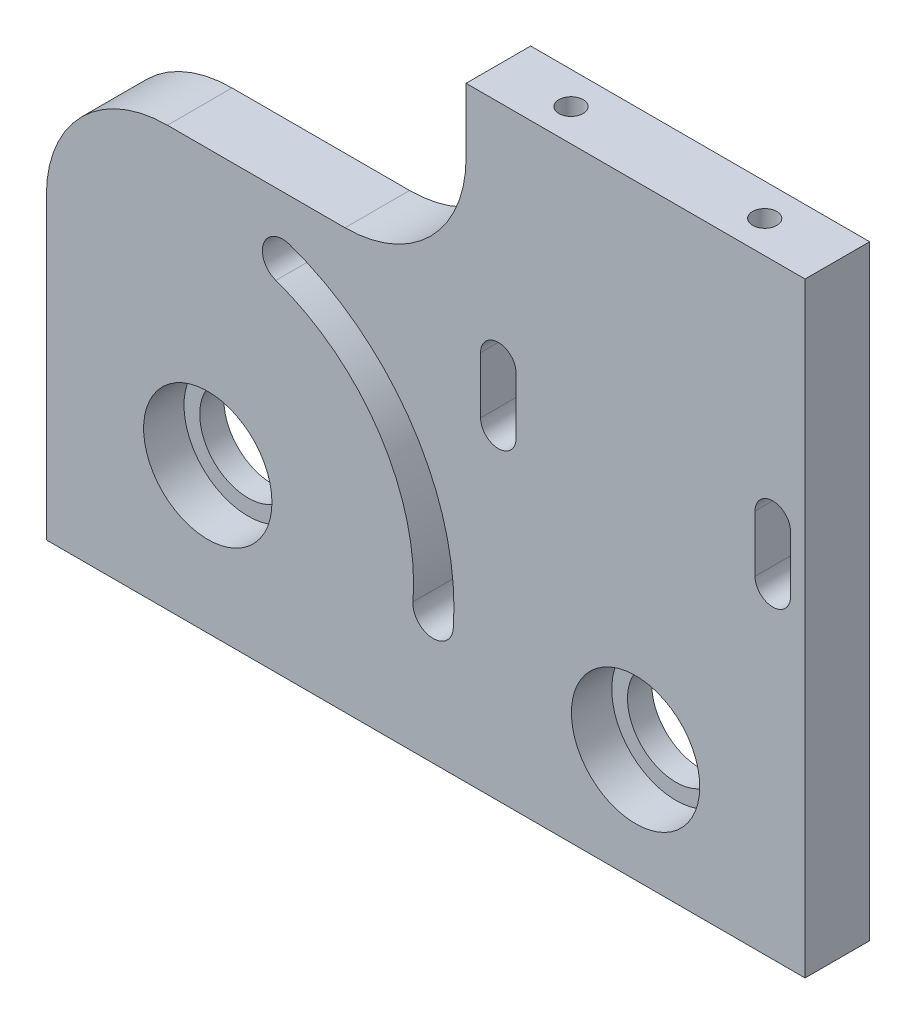
ISO-10303-21;
HEADER;
FILE_DESCRIPTION(('STEP AP214'),'2;1');
FILE_NAME('part.step','',(''),(''),'','','');
FILE_SCHEMA(('AUTOMOTIVE_DESIGN { 1 0 10303 214 1 1 1 1 }'));
ENDSEC;
DATA;
#1=APPLICATION_CONTEXT('core data for automotive mechanical design processes');
#2=APPLICATION_PROTOCOL_DEFINITION('international standard','automotive_design',2000,#1);
#3=PRODUCT_CONTEXT('',#1,'mechanical');
#4=PRODUCT('Part','Part','',(#3));
#5=PRODUCT_RELATED_PRODUCT_CATEGORY('part','',(#4));
#6=PRODUCT_DEFINITION_FORMATION('','',#4);
#7=PRODUCT_DEFINITION_CONTEXT('part definition',#1,'design');
#8=PRODUCT_DEFINITION('design','',#6,#7);
#9=PRODUCT_DEFINITION_SHAPE('','',#8);
#10=(LENGTH_UNIT() NAMED_UNIT(*) SI_UNIT(.MILLI.,.METRE.));
#11=(NAMED_UNIT(*) PLANE_ANGLE_UNIT() SI_UNIT($,.RADIAN.));
#12=(NAMED_UNIT(*) SI_UNIT($,.STERADIAN.) SOLID_ANGLE_UNIT());
#13=UNCERTAINTY_MEASURE_WITH_UNIT(LENGTH_MEASURE(1.E-05),#10,'distance_accuracy_value','');
#14=(GEOMETRIC_REPRESENTATION_CONTEXT(3) GLOBAL_UNCERTAINTY_ASSIGNED_CONTEXT((#13)) GLOBAL_UNIT_ASSIGNED_CONTEXT((#10,
#11,#12)) REPRESENTATION_CONTEXT('',''));
#15=CARTESIAN_POINT('',(0.,0.,0.));
#16=DIRECTION('',(0.,0.,1.));
#17=DIRECTION('',(1.,0.,0.));
#18=AXIS2_PLACEMENT_3D('',#15,#16,#17);
#19=CARTESIAN_POINT('',(0.,0.,8.));
#20=DIRECTION('',(1.,0.,0.));
#21=DIRECTION('',(0.,0.,-1.));
#22=AXIS2_PLACEMENT_3D('',#19,#20,#21);
#23=PLANE('',#22);
#24=DIRECTION('',(0.,-1.,0.));
#25=VECTOR('',#24,1.);
#26=CARTESIAN_POINT('',(0.,0.,8.));
#27=LINE('',#26,#25);
#28=CARTESIAN_POINT('',(0.,37.,8.));
#29=VERTEX_POINT('',#28);
#30=CARTESIAN_POINT('',(0.,0.,8.));
#31=VERTEX_POINT('',#30);
#32=EDGE_CURVE('E204',#29,#31,#27,.T.);
#33=ORIENTED_EDGE('',*,*,#32,.F.);
#34=DIRECTION('',(0.,0.,1.));
#35=VECTOR('',#34,1.);
#36=CARTESIAN_POINT('',(0.,37.,8.));
#37=LINE('',#36,#35);
#38=CARTESIAN_POINT('',(0.,37.,0.));
#39=VERTEX_POINT('',#38);
#40=EDGE_CURVE('E64',#29,#39,#37,.F.);
#41=ORIENTED_EDGE('',*,*,#40,.T.);
#42=DIRECTION('',(0.,-1.,0.));
#43=VECTOR('',#42,1.);
#44=CARTESIAN_POINT('',(0.,0.,0.));
#45=LINE('',#44,#43);
#46=CARTESIAN_POINT('',(0.,0.,0.));
#47=VERTEX_POINT('',#46);
#48=EDGE_CURVE('E210',#39,#47,#45,.T.);
#49=ORIENTED_EDGE('',*,*,#48,.T.);
#50=DIRECTION('',(0.,0.,-1.));
#51=VECTOR('',#50,1.);
#52=CARTESIAN_POINT('',(0.,0.,8.));
#53=LINE('',#52,#51);
#54=EDGE_CURVE('E214',#31,#47,#53,.T.);
#55=ORIENTED_EDGE('',*,*,#54,.F.);
#56=EDGE_LOOP('',(#33,#41,#49,#55));
#57=FACE_BOUND('',#56,.T.);
#58=ADVANCED_FACE('F43',(#57),#23,.F.);
#59=CARTESIAN_POINT('',(0.,0.,8.));
#60=DIRECTION('',(0.,1.,0.));
#61=DIRECTION('',(0.,0.,1.));
#62=AXIS2_PLACEMENT_3D('',#59,#60,#61);
#63=PLANE('',#62);
#64=CARTESIAN_POINT('',(6.00000000000001,0.,4.));
#65=DIRECTION('',(0.,-1.,0.));
#66=DIRECTION('',(0.,0.,-1.));
#67=AXIS2_PLACEMENT_3D('',#64,#65,#66);
#68=CIRCLE('',#67,1.5);
#69=CARTESIAN_POINT('',(6.00000000000001,0.,2.5));
#70=VERTEX_POINT('',#69);
#71=EDGE_CURVE('E380',#70,#70,#68,.T.);
#72=ORIENTED_EDGE('',*,*,#71,.F.);
#73=EDGE_LOOP('',(#72));
#74=FACE_BOUND('',#73,.T.);
#75=CARTESIAN_POINT('',(88.,0.,4.));
#76=DIRECTION('',(0.,-1.,0.));
#77=DIRECTION('',(0.,0.,-1.));
#78=AXIS2_PLACEMENT_3D('',#75,#76,#77);
#79=CIRCLE('',#78,1.5);
#80=CARTESIAN_POINT('',(88.,0.,2.5));
#81=VERTEX_POINT('',#80);
#82=EDGE_CURVE('E391',#81,#81,#79,.T.);
#83=ORIENTED_EDGE('',*,*,#82,.F.);
#84=EDGE_LOOP('',(#83));
#85=FACE_BOUND('',#84,.T.);
#86=DIRECTION('',(1.,0.,0.));
#87=VECTOR('',#86,1.);
#88=CARTESIAN_POINT('',(0.,0.,0.));
#89=LINE('',#88,#87);
#90=CARTESIAN_POINT('',(94.,0.,0.));
#91=VERTEX_POINT('',#90);
#92=EDGE_CURVE('E205',#47,#91,#89,.T.);
#93=ORIENTED_EDGE('',*,*,#92,.T.);
#94=DIRECTION('',(0.,0.,1.));
#95=VECTOR('',#94,1.);
#96=CARTESIAN_POINT('',(94.,0.,0.));
#97=LINE('',#96,#95);
#98=CARTESIAN_POINT('',(94.,0.,8.));
#99=VERTEX_POINT('',#98);
#100=EDGE_CURVE('E471',#91,#99,#97,.T.);
#101=ORIENTED_EDGE('',*,*,#100,.T.);
#102=DIRECTION('',(1.,0.,0.));
#103=VECTOR('',#102,1.);
#104=CARTESIAN_POINT('',(0.,0.,8.));
#105=LINE('',#104,#103);
#106=EDGE_CURVE('E207',#31,#99,#105,.T.);
#107=ORIENTED_EDGE('',*,*,#106,.F.);
#108=ORIENTED_EDGE('',*,*,#54,.T.);
#109=EDGE_LOOP('',(#93,#101,#107,#108));
#110=FACE_BOUND('',#109,.T.);
#111=ADVANCED_FACE('F254',(#74,#85,#110),#63,.F.);
#112=CARTESIAN_POINT('',(0.,75.,8.));
#113=DIRECTION('',(0.,-1.,0.));
#114=DIRECTION('',(0.,0.,-1.));
#115=AXIS2_PLACEMENT_3D('',#112,#113,#114);
#116=PLANE('',#115);
#117=CARTESIAN_POINT('',(85.,75.,4.));
#118=DIRECTION('',(0.,1.,0.));
#119=DIRECTION('',(0.,0.,1.));
#120=AXIS2_PLACEMENT_3D('',#117,#118,#119);
#121=CIRCLE('',#120,1.5);
#122=CARTESIAN_POINT('',(85.,75.,5.5));
#123=VERTEX_POINT('',#122);
#124=EDGE_CURVE('E397',#123,#123,#121,.T.);
#125=ORIENTED_EDGE('',*,*,#124,.F.);
#126=EDGE_LOOP('',(#125));
#127=FACE_BOUND('',#126,.T.);
#128=CARTESIAN_POINT('',(61.,75.,4.));
#129=DIRECTION('',(0.,1.,0.));
#130=DIRECTION('',(0.,0.,1.));
#131=AXIS2_PLACEMENT_3D('',#128,#129,#130);
#132=CIRCLE('',#131,1.5);
#133=CARTESIAN_POINT('',(61.,75.,5.5));
#134=VERTEX_POINT('',#133);
#135=EDGE_CURVE('E379',#134,#134,#132,.T.);
#136=ORIENTED_EDGE('',*,*,#135,.F.);
#137=EDGE_LOOP('',(#136));
#138=FACE_BOUND('',#137,.T.);
#139=DIRECTION('',(-1.,0.,0.));
#140=VECTOR('',#139,1.);
#141=CARTESIAN_POINT('',(0.,75.,0.));
#142=LINE('',#141,#140);
#143=CARTESIAN_POINT('',(94.,75.,0.));
#144=VERTEX_POINT('',#143);
#145=CARTESIAN_POINT('',(52.,75.,0.));
#146=VERTEX_POINT('',#145);
#147=EDGE_CURVE('E184',#144,#146,#142,.T.);
#148=ORIENTED_EDGE('',*,*,#147,.T.);
#149=DIRECTION('',(0.,0.,1.));
#150=VECTOR('',#149,1.);
#151=CARTESIAN_POINT('',(52.,75.,0.));
#152=LINE('',#151,#150);
#153=CARTESIAN_POINT('',(52.,75.,8.));
#154=VERTEX_POINT('',#153);
#155=EDGE_CURVE('E192',#146,#154,#152,.T.);
#156=ORIENTED_EDGE('',*,*,#155,.T.);
#157=DIRECTION('',(-1.,0.,0.));
#158=VECTOR('',#157,1.);
#159=CARTESIAN_POINT('',(0.,75.,8.));
#160=LINE('',#159,#158);
#161=CARTESIAN_POINT('',(94.,75.,8.));
#162=VERTEX_POINT('',#161);
#163=EDGE_CURVE('E218',#162,#154,#160,.T.);
#164=ORIENTED_EDGE('',*,*,#163,.F.);
#165=DIRECTION('',(0.,0.,1.));
#166=VECTOR('',#165,1.);
#167=CARTESIAN_POINT('',(94.,75.,0.));
#168=LINE('',#167,#166);
#169=EDGE_CURVE('E203',#144,#162,#168,.T.);
#170=ORIENTED_EDGE('',*,*,#169,.F.);
#171=EDGE_LOOP('',(#148,#156,#164,#170));
#172=FACE_BOUND('',#171,.T.);
#173=ADVANCED_FACE('F202',(#127,#138,#172),#116,.F.);
#174=CARTESIAN_POINT('',(0.,0.,8.));
#175=DIRECTION('',(0.,0.,-1.));
#176=DIRECTION('',(-1.,0.,0.));
#177=AXIS2_PLACEMENT_3D('',#174,#175,#176);
#178=PLANE('',#177);
#179=DIRECTION('',(0.,1.,0.));
#180=VECTOR('',#179,1.);
#181=CARTESIAN_POINT('',(92.2,40.,8.));
#182=LINE('',#181,#180);
#183=CARTESIAN_POINT('',(92.2,40.,8.));
#184=VERTEX_POINT('',#183);
#185=CARTESIAN_POINT('',(92.2,47.,8.));
#186=VERTEX_POINT('',#185);
#187=EDGE_CURVE('E420',#184,#186,#182,.T.);
#188=ORIENTED_EDGE('',*,*,#187,.F.);
#189=CARTESIAN_POINT('',(90.,40.,8.));
#190=DIRECTION('',(0.,0.,1.));
#191=DIRECTION('',(1.,0.,0.));
#192=AXIS2_PLACEMENT_3D('',#189,#190,#191);
#193=CIRCLE('',#192,2.19999999999999);
#194=CARTESIAN_POINT('',(87.8,40.,8.));
#195=VERTEX_POINT('',#194);
#196=EDGE_CURVE('E418',#195,#184,#193,.T.);
#197=ORIENTED_EDGE('',*,*,#196,.F.);
#198=DIRECTION('',(0.,-1.,0.));
#199=VECTOR('',#198,1.);
#200=CARTESIAN_POINT('',(87.8,40.,8.));
#201=LINE('',#200,#199);
#202=CARTESIAN_POINT('',(87.8,47.,8.));
#203=VERTEX_POINT('',#202);
#204=EDGE_CURVE('E408',#203,#195,#201,.T.);
#205=ORIENTED_EDGE('',*,*,#204,.F.);
#206=CARTESIAN_POINT('',(90.,47.,8.));
#207=DIRECTION('',(0.,0.,1.));
#208=DIRECTION('',(1.,0.,0.));
#209=AXIS2_PLACEMENT_3D('',#206,#207,#208);
#210=CIRCLE('',#209,2.19999999999999);
#211=EDGE_CURVE('E424',#186,#203,#210,.T.);
#212=ORIENTED_EDGE('',*,*,#211,.F.);
#213=EDGE_LOOP('',(#188,#197,#205,#212));
#214=FACE_BOUND('',#213,.T.);
#215=DIRECTION('',(0.,1.,0.));
#216=VECTOR('',#215,1.);
#217=CARTESIAN_POINT('',(58.2,40.,8.));
#218=LINE('',#217,#216);
#219=CARTESIAN_POINT('',(58.2,40.,8.));
#220=VERTEX_POINT('',#219);
#221=CARTESIAN_POINT('',(58.2,47.,8.));
#222=VERTEX_POINT('',#221);
#223=EDGE_CURVE('E453',#220,#222,#218,.T.);
#224=ORIENTED_EDGE('',*,*,#223,.F.);
#225=CARTESIAN_POINT('',(56.,40.,8.));
#226=DIRECTION('',(0.,0.,1.));
#227=DIRECTION('',(-1.,0.,0.));
#228=AXIS2_PLACEMENT_3D('',#225,#226,#227);
#229=CIRCLE('',#228,2.19999999999999);
#230=CARTESIAN_POINT('',(53.8,40.,8.));
#231=VERTEX_POINT('',#230);
#232=EDGE_CURVE('E199',#231,#220,#229,.T.);
#233=ORIENTED_EDGE('',*,*,#232,.F.);
#234=DIRECTION('',(0.,-1.,0.));
#235=VECTOR('',#234,1.);
#236=CARTESIAN_POINT('',(53.8,40.,8.));
#237=LINE('',#236,#235);
#238=CARTESIAN_POINT('',(53.8,47.,8.));
#239=VERTEX_POINT('',#238);
#240=EDGE_CURVE('E442',#239,#231,#237,.T.);
#241=ORIENTED_EDGE('',*,*,#240,.F.);
#242=CARTESIAN_POINT('',(56.,47.,8.));
#243=DIRECTION('',(0.,0.,1.));
#244=DIRECTION('',(-1.,0.,0.));
#245=AXIS2_PLACEMENT_3D('',#242,#243,#244);
#246=CIRCLE('',#245,2.19999999999999);
#247=EDGE_CURVE('E456',#222,#239,#246,.T.);
#248=ORIENTED_EDGE('',*,*,#247,.F.);
#249=EDGE_LOOP('',(#224,#233,#241,#248));
#250=FACE_BOUND('',#249,.T.);
#251=CARTESIAN_POINT('',(20.,18.,8.));
#252=DIRECTION('',(0.,0.,1.));
#253=DIRECTION('',(1.,0.,0.));
#254=AXIS2_PLACEMENT_3D('',#251,#252,#253);
#255=CIRCLE('',#254,30.5);
#256=CARTESIAN_POINT('',(50.4135056748417,15.704641081144,8.));
#257=VERTEX_POINT('',#256);
#258=CARTESIAN_POINT('',(30.0887409573085,46.7831079957729,8.));
#259=VERTEX_POINT('',#258);
#260=EDGE_CURVE('E491',#257,#259,#255,.T.);
#261=ORIENTED_EDGE('',*,*,#260,.F.);
#262=CARTESIAN_POINT('',(47.9205953736252,15.8927852548207,8.));
#263=DIRECTION('',(0.,0.,1.));
#264=DIRECTION('',(1.,0.,0.));
#265=AXIS2_PLACEMENT_3D('',#262,#263,#264);
#266=CIRCLE('',#265,2.49999999999999);
#267=CARTESIAN_POINT('',(45.4276850724086,16.0809294284975,8.));
#268=VERTEX_POINT('',#267);
#269=EDGE_CURVE('E474',#268,#257,#266,.T.);
#270=ORIENTED_EDGE('',*,*,#269,.F.);
#271=CARTESIAN_POINT('',(20.,18.,8.));
#272=DIRECTION('',(0.,0.,-1.));
#273=DIRECTION('',(1.,0.,0.));
#274=AXIS2_PLACEMENT_3D('',#271,#272,#273);
#275=CIRCLE('',#274,25.5);
#276=CARTESIAN_POINT('',(28.434848997094,42.0645657013839,8.));
#277=VERTEX_POINT('',#276);
#278=EDGE_CURVE('E480',#277,#268,#275,.T.);
#279=ORIENTED_EDGE('',*,*,#278,.F.);
#280=CARTESIAN_POINT('',(29.2617949772012,44.4238368485784,8.));
#281=DIRECTION('',(0.,0.,1.));
#282=DIRECTION('',(1.,0.,0.));
#283=AXIS2_PLACEMENT_3D('',#280,#281,#282);
#284=CIRCLE('',#283,2.5);
#285=EDGE_CURVE('E494',#259,#277,#284,.T.);
#286=ORIENTED_EDGE('',*,*,#285,.F.);
#287=EDGE_LOOP('',(#261,#270,#279,#286));
#288=FACE_BOUND('',#287,.T.);
#289=CARTESIAN_POINT('',(20.,18.,8.));
#290=DIRECTION('',(0.,0.,1.));
#291=DIRECTION('',(1.,0.,0.));
#292=AXIS2_PLACEMENT_3D('',#289,#290,#291);
#293=CIRCLE('',#292,7.95);
#294=CARTESIAN_POINT('',(27.95,18.,8.));
#295=VERTEX_POINT('',#294);
#296=EDGE_CURVE('E523',#295,#295,#293,.T.);
#297=ORIENTED_EDGE('',*,*,#296,.F.);
#298=EDGE_LOOP('',(#297));
#299=FACE_BOUND('',#298,.T.);
#300=CARTESIAN_POINT('',(73.,14.,8.));
#301=DIRECTION('',(0.,0.,1.));
#302=DIRECTION('',(1.,0.,0.));
#303=AXIS2_PLACEMENT_3D('',#300,#301,#302);
#304=CIRCLE('',#303,7.95);
#305=CARTESIAN_POINT('',(80.95,14.,8.));
#306=VERTEX_POINT('',#305);
#307=EDGE_CURVE('E511',#306,#306,#304,.T.);
#308=ORIENTED_EDGE('',*,*,#307,.F.);
#309=EDGE_LOOP('',(#308));
#310=FACE_BOUND('',#309,.T.);
#311=DIRECTION('',(1.,0.,0.));
#312=VECTOR('',#311,1.);
#313=CARTESIAN_POINT('',(52.,52.,8.));
#314=LINE('',#313,#312);
#315=CARTESIAN_POINT('',(15.,52.,8.));
#316=VERTEX_POINT('',#315);
#317=CARTESIAN_POINT('',(37.,52.,8.));
#318=VERTEX_POINT('',#317);
#319=EDGE_CURVE('E189',#316,#318,#314,.T.);
#320=ORIENTED_EDGE('',*,*,#319,.F.);
#321=CARTESIAN_POINT('',(15.,37.,8.));
#322=DIRECTION('',(0.,0.,-1.));
#323=DIRECTION('',(-1.,0.,0.));
#324=AXIS2_PLACEMENT_3D('',#321,#322,#323);
#325=CIRCLE('',#324,15.);
#326=EDGE_CURVE('E223',#316,#29,#325,.F.);
#327=ORIENTED_EDGE('',*,*,#326,.T.);
#328=ORIENTED_EDGE('',*,*,#32,.T.);
#329=ORIENTED_EDGE('',*,*,#106,.T.);
#330=DIRECTION('',(0.,-1.,0.));
#331=VECTOR('',#330,1.);
#332=CARTESIAN_POINT('',(94.,0.,8.));
#333=LINE('',#332,#331);
#334=EDGE_CURVE('E431',#162,#99,#333,.T.);
#335=ORIENTED_EDGE('',*,*,#334,.F.);
#336=ORIENTED_EDGE('',*,*,#163,.T.);
#337=DIRECTION('',(0.,1.,0.));
#338=VECTOR('',#337,1.);
#339=CARTESIAN_POINT('',(52.,75.,8.));
#340=LINE('',#339,#338);
#341=CARTESIAN_POINT('',(52.,67.,8.));
#342=VERTEX_POINT('',#341);
#343=EDGE_CURVE('E195',#342,#154,#340,.T.);
#344=ORIENTED_EDGE('',*,*,#343,.F.);
#345=CARTESIAN_POINT('',(37.,67.,8.));
#346=DIRECTION('',(0.,0.,-1.));
#347=DIRECTION('',(-1.,0.,0.));
#348=AXIS2_PLACEMENT_3D('',#345,#346,#347);
#349=CIRCLE('',#348,15.);
#350=EDGE_CURVE('E51',#342,#318,#349,.T.);
#351=ORIENTED_EDGE('',*,*,#350,.T.);
#352=EDGE_LOOP('',(#320,#327,#328,#329,#335,#336,#344,#351));
#353=FACE_BOUND('',#352,.T.);
#354=ADVANCED_FACE('F232',(#214,#250,#288,#299,#310,#353),#178,.F.);
#355=CARTESIAN_POINT('',(0.,0.,0.));
#356=DIRECTION('',(0.,0.,-1.));
#357=DIRECTION('',(-1.,0.,0.));
#358=AXIS2_PLACEMENT_3D('',#355,#356,#357);
#359=PLANE('',#358);
#360=ORIENTED_EDGE('',*,*,#48,.F.);
#361=CARTESIAN_POINT('',(15.,37.,0.));
#362=DIRECTION('',(0.,0.,-1.));
#363=DIRECTION('',(-1.,0.,0.));
#364=AXIS2_PLACEMENT_3D('',#361,#362,#363);
#365=CIRCLE('',#364,15.);
#366=CARTESIAN_POINT('',(15.,52.,0.));
#367=VERTEX_POINT('',#366);
#368=EDGE_CURVE('E226',#39,#367,#365,.T.);
#369=ORIENTED_EDGE('',*,*,#368,.T.);
#370=DIRECTION('',(1.,0.,0.));
#371=VECTOR('',#370,1.);
#372=CARTESIAN_POINT('',(52.,52.,0.));
#373=LINE('',#372,#371);
#374=CARTESIAN_POINT('',(37.,52.,0.));
#375=VERTEX_POINT('',#374);
#376=EDGE_CURVE('E188',#367,#375,#373,.T.);
#377=ORIENTED_EDGE('',*,*,#376,.T.);
#378=CARTESIAN_POINT('',(37.,67.,0.));
#379=DIRECTION('',(0.,0.,-1.));
#380=DIRECTION('',(-1.,0.,0.));
#381=AXIS2_PLACEMENT_3D('',#378,#379,#380);
#382=CIRCLE('',#381,15.);
#383=CARTESIAN_POINT('',(52.,67.,0.));
#384=VERTEX_POINT('',#383);
#385=EDGE_CURVE('E11',#375,#384,#382,.F.);
#386=ORIENTED_EDGE('',*,*,#385,.T.);
#387=DIRECTION('',(0.,1.,0.));
#388=VECTOR('',#387,1.);
#389=CARTESIAN_POINT('',(52.,75.,0.));
#390=LINE('',#389,#388);
#391=EDGE_CURVE('E178',#384,#146,#390,.T.);
#392=ORIENTED_EDGE('',*,*,#391,.T.);
#393=ORIENTED_EDGE('',*,*,#147,.F.);
#394=DIRECTION('',(0.,-1.,0.));
#395=VECTOR('',#394,1.);
#396=CARTESIAN_POINT('',(94.,0.,0.));
#397=LINE('',#396,#395);
#398=EDGE_CURVE('E468',#144,#91,#397,.T.);
#399=ORIENTED_EDGE('',*,*,#398,.T.);
#400=ORIENTED_EDGE('',*,*,#92,.F.);
#401=EDGE_LOOP('',(#360,#369,#377,#386,#392,#393,#399,#400));
#402=FACE_BOUND('',#401,.T.);
#403=CARTESIAN_POINT('',(90.,40.,0.));
#404=DIRECTION('',(0.,0.,1.));
#405=DIRECTION('',(1.,0.,0.));
#406=AXIS2_PLACEMENT_3D('',#403,#404,#405);
#407=CIRCLE('',#406,2.19999999999999);
#408=CARTESIAN_POINT('',(87.8,40.,0.));
#409=VERTEX_POINT('',#408);
#410=CARTESIAN_POINT('',(92.2,40.,0.));
#411=VERTEX_POINT('',#410);
#412=EDGE_CURVE('E404',#409,#411,#407,.T.);
#413=ORIENTED_EDGE('',*,*,#412,.T.);
#414=DIRECTION('',(0.,1.,0.));
#415=VECTOR('',#414,1.);
#416=CARTESIAN_POINT('',(92.2,40.,0.));
#417=LINE('',#416,#415);
#418=CARTESIAN_POINT('',(92.2,47.,0.));
#419=VERTEX_POINT('',#418);
#420=EDGE_CURVE('E407',#411,#419,#417,.T.);
#421=ORIENTED_EDGE('',*,*,#420,.T.);
#422=CARTESIAN_POINT('',(90.,47.,0.));
#423=DIRECTION('',(0.,0.,1.));
#424=DIRECTION('',(1.,0.,0.));
#425=AXIS2_PLACEMENT_3D('',#422,#423,#424);
#426=CIRCLE('',#425,2.19999999999999);
#427=CARTESIAN_POINT('',(87.8,47.,0.));
#428=VERTEX_POINT('',#427);
#429=EDGE_CURVE('E411',#419,#428,#426,.T.);
#430=ORIENTED_EDGE('',*,*,#429,.T.);
#431=DIRECTION('',(0.,-1.,0.));
#432=VECTOR('',#431,1.);
#433=CARTESIAN_POINT('',(87.8,40.,0.));
#434=LINE('',#433,#432);
#435=EDGE_CURVE('E414',#428,#409,#434,.T.);
#436=ORIENTED_EDGE('',*,*,#435,.T.);
#437=EDGE_LOOP('',(#413,#421,#430,#436));
#438=FACE_BOUND('',#437,.T.);
#439=CARTESIAN_POINT('',(56.,40.,0.));
#440=DIRECTION('',(0.,0.,1.));
#441=DIRECTION('',(-1.,0.,0.));
#442=AXIS2_PLACEMENT_3D('',#439,#440,#441);
#443=CIRCLE('',#442,2.19999999999999);
#444=CARTESIAN_POINT('',(53.8,40.,0.));
#445=VERTEX_POINT('',#444);
#446=CARTESIAN_POINT('',(58.2,40.,0.));
#447=VERTEX_POINT('',#446);
#448=EDGE_CURVE('E438',#445,#447,#443,.T.);
#449=ORIENTED_EDGE('',*,*,#448,.T.);
#450=DIRECTION('',(0.,1.,0.));
#451=VECTOR('',#450,1.);
#452=CARTESIAN_POINT('',(58.2,40.,0.));
#453=LINE('',#452,#451);
#454=CARTESIAN_POINT('',(58.2,47.,0.));
#455=VERTEX_POINT('',#454);
#456=EDGE_CURVE('E441',#447,#455,#453,.T.);
#457=ORIENTED_EDGE('',*,*,#456,.T.);
#458=CARTESIAN_POINT('',(56.,47.,0.));
#459=DIRECTION('',(0.,0.,1.));
#460=DIRECTION('',(-1.,0.,0.));
#461=AXIS2_PLACEMENT_3D('',#458,#459,#460);
#462=CIRCLE('',#461,2.19999999999999);
#463=CARTESIAN_POINT('',(53.8,47.,0.));
#464=VERTEX_POINT('',#463);
#465=EDGE_CURVE('E445',#455,#464,#462,.T.);
#466=ORIENTED_EDGE('',*,*,#465,.T.);
#467=DIRECTION('',(0.,-1.,0.));
#468=VECTOR('',#467,1.);
#469=CARTESIAN_POINT('',(53.8,40.,0.));
#470=LINE('',#469,#468);
#471=EDGE_CURVE('E448',#464,#445,#470,.T.);
#472=ORIENTED_EDGE('',*,*,#471,.T.);
#473=EDGE_LOOP('',(#449,#457,#466,#472));
#474=FACE_BOUND('',#473,.T.);
#475=CARTESIAN_POINT('',(47.9205953736252,15.8927852548207,0.));
#476=DIRECTION('',(0.,0.,1.));
#477=DIRECTION('',(1.,0.,0.));
#478=AXIS2_PLACEMENT_3D('',#475,#476,#477);
#479=CIRCLE('',#478,2.49999999999999);
#480=CARTESIAN_POINT('',(45.4276850724086,16.0809294284975,0.));
#481=VERTEX_POINT('',#480);
#482=CARTESIAN_POINT('',(50.4135056748417,15.704641081144,0.));
#483=VERTEX_POINT('',#482);
#484=EDGE_CURVE('E476',#481,#483,#479,.T.);
#485=ORIENTED_EDGE('',*,*,#484,.T.);
#486=CARTESIAN_POINT('',(20.,18.,0.));
#487=DIRECTION('',(0.,0.,1.));
#488=DIRECTION('',(1.,0.,0.));
#489=AXIS2_PLACEMENT_3D('',#486,#487,#488);
#490=CIRCLE('',#489,30.5);
#491=CARTESIAN_POINT('',(30.0887409573085,46.7831079957729,0.));
#492=VERTEX_POINT('',#491);
#493=EDGE_CURVE('E479',#483,#492,#490,.T.);
#494=ORIENTED_EDGE('',*,*,#493,.T.);
#495=CARTESIAN_POINT('',(29.2617949772012,44.4238368485784,0.));
#496=DIRECTION('',(0.,0.,1.));
#497=DIRECTION('',(1.,0.,0.));
#498=AXIS2_PLACEMENT_3D('',#495,#496,#497);
#499=CIRCLE('',#498,2.5);
#500=CARTESIAN_POINT('',(28.434848997094,42.0645657013839,0.));
#501=VERTEX_POINT('',#500);
#502=EDGE_CURVE('E483',#492,#501,#499,.T.);
#503=ORIENTED_EDGE('',*,*,#502,.T.);
#504=CARTESIAN_POINT('',(20.,18.,0.));
#505=DIRECTION('',(0.,0.,-1.));
#506=DIRECTION('',(1.,0.,0.));
#507=AXIS2_PLACEMENT_3D('',#504,#505,#506);
#508=CIRCLE('',#507,25.5);
#509=EDGE_CURVE('E486',#501,#481,#508,.T.);
#510=ORIENTED_EDGE('',*,*,#509,.T.);
#511=EDGE_LOOP('',(#485,#494,#503,#510));
#512=FACE_BOUND('',#511,.T.);
#513=CARTESIAN_POINT('',(20.,18.,0.));
#514=DIRECTION('',(0.,0.,-1.));
#515=DIRECTION('',(-1.,0.,0.));
#516=AXIS2_PLACEMENT_3D('',#513,#514,#515);
#517=CIRCLE('',#516,6.);
#518=CARTESIAN_POINT('',(14.,18.,0.));
#519=VERTEX_POINT('',#518);
#520=EDGE_CURVE('E512',#519,#519,#517,.F.);
#521=ORIENTED_EDGE('',*,*,#520,.T.);
#522=EDGE_LOOP('',(#521));
#523=FACE_BOUND('',#522,.T.);
#524=CARTESIAN_POINT('',(73.,14.,0.));
#525=DIRECTION('',(0.,0.,-1.));
#526=DIRECTION('',(-1.,0.,0.));
#527=AXIS2_PLACEMENT_3D('',#524,#525,#526);
#528=CIRCLE('',#527,6.);
#529=CARTESIAN_POINT('',(67.,14.,0.));
#530=VERTEX_POINT('',#529);
#531=EDGE_CURVE('E501',#530,#530,#528,.F.);
#532=ORIENTED_EDGE('',*,*,#531,.T.);
#533=EDGE_LOOP('',(#532));
#534=FACE_BOUND('',#533,.T.);
#535=ADVANCED_FACE('F180',(#402,#438,#474,#512,#523,#534),#359,.T.);
#536=CARTESIAN_POINT('',(73.,14.,3.));
#537=DIRECTION('',(0.,0.,1.));
#538=DIRECTION('',(1.,0.,0.));
#539=AXIS2_PLACEMENT_3D('',#536,#537,#538);
#540=CYLINDRICAL_SURFACE('',#539,7.95);
#541=CARTESIAN_POINT('',(73.,14.,3.));
#542=DIRECTION('',(0.,0.,1.));
#543=DIRECTION('',(1.,0.,0.));
#544=AXIS2_PLACEMENT_3D('',#541,#542,#543);
#545=CIRCLE('',#544,7.95);
#546=CARTESIAN_POINT('',(80.95,14.,3.));
#547=VERTEX_POINT('',#546);
#548=EDGE_CURVE('E526',#547,#547,#545,.T.);
#549=ORIENTED_EDGE('',*,*,#548,.F.);
#550=EDGE_LOOP('',(#549));
#551=FACE_BOUND('',#550,.T.);
#552=ORIENTED_EDGE('',*,*,#307,.T.);
#553=EDGE_LOOP('',(#552));
#554=FACE_BOUND('',#553,.T.);
#555=ADVANCED_FACE('F268',(#551,#554),#540,.F.);
#556=CARTESIAN_POINT('',(73.,14.,3.));
#557=DIRECTION('',(0.,0.,1.));
#558=DIRECTION('',(1.,0.,0.));
#559=AXIS2_PLACEMENT_3D('',#556,#557,#558);
#560=PLANE('',#559);
#561=CARTESIAN_POINT('',(73.,14.,3.));
#562=DIRECTION('',(0.,0.,1.));
#563=DIRECTION('',(1.,0.,0.));
#564=AXIS2_PLACEMENT_3D('',#561,#562,#563);
#565=CIRCLE('',#564,6.);
#566=CARTESIAN_POINT('',(79.,14.,3.));
#567=VERTEX_POINT('',#566);
#568=EDGE_CURVE('E515',#567,#567,#565,.T.);
#569=ORIENTED_EDGE('',*,*,#568,.F.);
#570=EDGE_LOOP('',(#569));
#571=FACE_BOUND('',#570,.T.);
#572=ORIENTED_EDGE('',*,*,#548,.T.);
#573=EDGE_LOOP('',(#572));
#574=FACE_BOUND('',#573,.T.);
#575=ADVANCED_FACE('F273',(#571,#574),#560,.T.);
#576=CARTESIAN_POINT('',(20.,18.,3.));
#577=DIRECTION('',(0.,0.,1.));
#578=DIRECTION('',(1.,0.,0.));
#579=AXIS2_PLACEMENT_3D('',#576,#577,#578);
#580=CYLINDRICAL_SURFACE('',#579,7.95);
#581=CARTESIAN_POINT('',(20.,18.,3.));
#582=DIRECTION('',(0.,0.,1.));
#583=DIRECTION('',(1.,0.,0.));
#584=AXIS2_PLACEMENT_3D('',#581,#582,#583);
#585=CIRCLE('',#584,7.95);
#586=CARTESIAN_POINT('',(27.95,18.,3.));
#587=VERTEX_POINT('',#586);
#588=EDGE_CURVE('E520',#587,#587,#585,.T.);
#589=ORIENTED_EDGE('',*,*,#588,.F.);
#590=EDGE_LOOP('',(#589));
#591=FACE_BOUND('',#590,.T.);
#592=ORIENTED_EDGE('',*,*,#296,.T.);
#593=EDGE_LOOP('',(#592));
#594=FACE_BOUND('',#593,.T.);
#595=ADVANCED_FACE('F277',(#591,#594),#580,.F.);
#596=CARTESIAN_POINT('',(20.,18.,3.));
#597=DIRECTION('',(0.,0.,1.));
#598=DIRECTION('',(1.,0.,0.));
#599=AXIS2_PLACEMENT_3D('',#596,#597,#598);
#600=PLANE('',#599);
#601=CARTESIAN_POINT('',(20.,18.,3.));
#602=DIRECTION('',(0.,0.,1.));
#603=DIRECTION('',(1.,0.,0.));
#604=AXIS2_PLACEMENT_3D('',#601,#602,#603);
#605=CIRCLE('',#604,6.);
#606=CARTESIAN_POINT('',(26.,18.,3.));
#607=VERTEX_POINT('',#606);
#608=EDGE_CURVE('E508',#607,#607,#605,.T.);
#609=ORIENTED_EDGE('',*,*,#608,.F.);
#610=EDGE_LOOP('',(#609));
#611=FACE_BOUND('',#610,.T.);
#612=ORIENTED_EDGE('',*,*,#588,.T.);
#613=EDGE_LOOP('',(#612));
#614=FACE_BOUND('',#613,.T.);
#615=ADVANCED_FACE('F281',(#611,#614),#600,.T.);
#616=CARTESIAN_POINT('',(73.,14.,-0.00100000000000013));
#617=DIRECTION('',(0.,0.,1.));
#618=DIRECTION('',(1.,0.,0.));
#619=AXIS2_PLACEMENT_3D('',#616,#617,#618);
#620=CYLINDRICAL_SURFACE('',#619,6.);
#621=ORIENTED_EDGE('',*,*,#531,.F.);
#622=EDGE_LOOP('',(#621));
#623=FACE_BOUND('',#622,.T.);
#624=ORIENTED_EDGE('',*,*,#568,.T.);
#625=EDGE_LOOP('',(#624));
#626=FACE_BOUND('',#625,.T.);
#627=ADVANCED_FACE('F285',(#623,#626),#620,.F.);
#628=CARTESIAN_POINT('',(20.,18.,-0.00100000000000013));
#629=DIRECTION('',(0.,0.,1.));
#630=DIRECTION('',(1.,0.,0.));
#631=AXIS2_PLACEMENT_3D('',#628,#629,#630);
#632=CYLINDRICAL_SURFACE('',#631,6.);
#633=ORIENTED_EDGE('',*,*,#520,.F.);
#634=EDGE_LOOP('',(#633));
#635=FACE_BOUND('',#634,.T.);
#636=ORIENTED_EDGE('',*,*,#608,.T.);
#637=EDGE_LOOP('',(#636));
#638=FACE_BOUND('',#637,.T.);
#639=ADVANCED_FACE('F289',(#635,#638),#632,.F.);
#640=CARTESIAN_POINT('',(47.9205953736252,15.8927852548207,0.));
#641=DIRECTION('',(0.,0.,1.));
#642=DIRECTION('',(1.,0.,0.));
#643=AXIS2_PLACEMENT_3D('',#640,#641,#642);
#644=CYLINDRICAL_SURFACE('',#643,2.49999999999999);
#645=ORIENTED_EDGE('',*,*,#269,.T.);
#646=DIRECTION('',(0.,0.,1.));
#647=VECTOR('',#646,1.);
#648=CARTESIAN_POINT('',(50.4135056748417,15.704641081144,0.));
#649=LINE('',#648,#647);
#650=EDGE_CURVE('E489',#483,#257,#649,.T.);
#651=ORIENTED_EDGE('',*,*,#650,.F.);
#652=ORIENTED_EDGE('',*,*,#484,.F.);
#653=DIRECTION('',(0.,0.,1.));
#654=VECTOR('',#653,1.);
#655=CARTESIAN_POINT('',(45.4276850724086,16.0809294284975,0.));
#656=LINE('',#655,#654);
#657=EDGE_CURVE('E499',#481,#268,#656,.T.);
#658=ORIENTED_EDGE('',*,*,#657,.T.);
#659=EDGE_LOOP('',(#645,#651,#652,#658));
#660=FACE_BOUND('',#659,.T.);
#661=ADVANCED_FACE('F293',(#660),#644,.F.);
#662=CARTESIAN_POINT('',(20.,18.,0.));
#663=DIRECTION('',(0.,0.,1.));
#664=DIRECTION('',(1.,0.,0.));
#665=AXIS2_PLACEMENT_3D('',#662,#663,#664);
#666=CYLINDRICAL_SURFACE('',#665,25.5);
#667=ORIENTED_EDGE('',*,*,#278,.T.);
#668=ORIENTED_EDGE('',*,*,#657,.F.);
#669=ORIENTED_EDGE('',*,*,#509,.F.);
#670=DIRECTION('',(0.,0.,1.));
#671=VECTOR('',#670,1.);
#672=CARTESIAN_POINT('',(28.434848997094,42.0645657013839,0.));
#673=LINE('',#672,#671);
#674=EDGE_CURVE('E502',#501,#277,#673,.T.);
#675=ORIENTED_EDGE('',*,*,#674,.T.);
#676=EDGE_LOOP('',(#667,#668,#669,#675));
#677=FACE_BOUND('',#676,.T.);
#678=ADVANCED_FACE('F297',(#677),#666,.T.);
#679=CARTESIAN_POINT('',(29.2617949772012,44.4238368485784,0.));
#680=DIRECTION('',(0.,0.,1.));
#681=DIRECTION('',(1.,0.,0.));
#682=AXIS2_PLACEMENT_3D('',#679,#680,#681);
#683=CYLINDRICAL_SURFACE('',#682,2.5);
#684=ORIENTED_EDGE('',*,*,#285,.T.);
#685=ORIENTED_EDGE('',*,*,#674,.F.);
#686=ORIENTED_EDGE('',*,*,#502,.F.);
#687=DIRECTION('',(0.,0.,1.));
#688=VECTOR('',#687,1.);
#689=CARTESIAN_POINT('',(30.0887409573085,46.7831079957729,0.));
#690=LINE('',#689,#688);
#691=EDGE_CURVE('E504',#492,#259,#690,.T.);
#692=ORIENTED_EDGE('',*,*,#691,.T.);
#693=EDGE_LOOP('',(#684,#685,#686,#692));
#694=FACE_BOUND('',#693,.T.);
#695=ADVANCED_FACE('F303',(#694),#683,.F.);
#696=CARTESIAN_POINT('',(20.,18.,0.));
#697=DIRECTION('',(0.,0.,1.));
#698=DIRECTION('',(1.,0.,0.));
#699=AXIS2_PLACEMENT_3D('',#696,#697,#698);
#700=CYLINDRICAL_SURFACE('',#699,30.5);
#701=ORIENTED_EDGE('',*,*,#260,.T.);
#702=ORIENTED_EDGE('',*,*,#691,.F.);
#703=ORIENTED_EDGE('',*,*,#493,.F.);
#704=ORIENTED_EDGE('',*,*,#650,.T.);
#705=EDGE_LOOP('',(#701,#702,#703,#704));
#706=FACE_BOUND('',#705,.T.);
#707=ADVANCED_FACE('F299',(#706),#700,.F.);
#708=CARTESIAN_POINT('',(94.,0.,0.));
#709=DIRECTION('',(-1.,0.,0.));
#710=DIRECTION('',(0.,0.,1.));
#711=AXIS2_PLACEMENT_3D('',#708,#709,#710);
#712=PLANE('',#711);
#713=ORIENTED_EDGE('',*,*,#334,.T.);
#714=ORIENTED_EDGE('',*,*,#100,.F.);
#715=ORIENTED_EDGE('',*,*,#398,.F.);
#716=ORIENTED_EDGE('',*,*,#169,.T.);
#717=EDGE_LOOP('',(#713,#714,#715,#716));
#718=FACE_BOUND('',#717,.T.);
#719=ADVANCED_FACE('F302',(#718),#712,.F.);
#720=CARTESIAN_POINT('',(56.,40.,0.));
#721=DIRECTION('',(0.,0.,1.));
#722=DIRECTION('',(1.,0.,0.));
#723=AXIS2_PLACEMENT_3D('',#720,#721,#722);
#724=CYLINDRICAL_SURFACE('',#723,2.19999999999999);
#725=ORIENTED_EDGE('',*,*,#232,.T.);
#726=DIRECTION('',(0.,0.,1.));
#727=VECTOR('',#726,1.);
#728=CARTESIAN_POINT('',(58.2,40.,0.));
#729=LINE('',#728,#727);
#730=EDGE_CURVE('E451',#447,#220,#729,.T.);
#731=ORIENTED_EDGE('',*,*,#730,.F.);
#732=ORIENTED_EDGE('',*,*,#448,.F.);
#733=DIRECTION('',(0.,0.,1.));
#734=VECTOR('',#733,1.);
#735=CARTESIAN_POINT('',(53.8,40.,0.));
#736=LINE('',#735,#734);
#737=EDGE_CURVE('E421',#445,#231,#736,.T.);
#738=ORIENTED_EDGE('',*,*,#737,.T.);
#739=EDGE_LOOP('',(#725,#731,#732,#738));
#740=FACE_BOUND('',#739,.T.);
#741=ADVANCED_FACE('F313',(#740),#724,.F.);
#742=CARTESIAN_POINT('',(53.8,40.,0.));
#743=DIRECTION('',(-1.,0.,0.));
#744=DIRECTION('',(0.,0.,1.));
#745=AXIS2_PLACEMENT_3D('',#742,#743,#744);
#746=PLANE('',#745);
#747=ORIENTED_EDGE('',*,*,#240,.T.);
#748=ORIENTED_EDGE('',*,*,#737,.F.);
#749=ORIENTED_EDGE('',*,*,#471,.F.);
#750=DIRECTION('',(0.,0.,1.));
#751=VECTOR('',#750,1.);
#752=CARTESIAN_POINT('',(53.8,47.,0.));
#753=LINE('',#752,#751);
#754=EDGE_CURVE('E462',#464,#239,#753,.T.);
#755=ORIENTED_EDGE('',*,*,#754,.T.);
#756=EDGE_LOOP('',(#747,#748,#749,#755));
#757=FACE_BOUND('',#756,.T.);
#758=ADVANCED_FACE('F317',(#757),#746,.F.);
#759=CARTESIAN_POINT('',(56.,47.,0.));
#760=DIRECTION('',(0.,0.,1.));
#761=DIRECTION('',(1.,0.,0.));
#762=AXIS2_PLACEMENT_3D('',#759,#760,#761);
#763=CYLINDRICAL_SURFACE('',#762,2.19999999999999);
#764=ORIENTED_EDGE('',*,*,#247,.T.);
#765=ORIENTED_EDGE('',*,*,#754,.F.);
#766=ORIENTED_EDGE('',*,*,#465,.F.);
#767=DIRECTION('',(0.,0.,1.));
#768=VECTOR('',#767,1.);
#769=CARTESIAN_POINT('',(58.2,47.,0.));
#770=LINE('',#769,#768);
#771=EDGE_CURVE('E464',#455,#222,#770,.T.);
#772=ORIENTED_EDGE('',*,*,#771,.T.);
#773=EDGE_LOOP('',(#764,#765,#766,#772));
#774=FACE_BOUND('',#773,.T.);
#775=ADVANCED_FACE('F323',(#774),#763,.F.);
#776=CARTESIAN_POINT('',(58.2,40.,0.));
#777=DIRECTION('',(1.,0.,0.));
#778=DIRECTION('',(0.,0.,-1.));
#779=AXIS2_PLACEMENT_3D('',#776,#777,#778);
#780=PLANE('',#779);
#781=ORIENTED_EDGE('',*,*,#223,.T.);
#782=ORIENTED_EDGE('',*,*,#771,.F.);
#783=ORIENTED_EDGE('',*,*,#456,.F.);
#784=ORIENTED_EDGE('',*,*,#730,.T.);
#785=EDGE_LOOP('',(#781,#782,#783,#784));
#786=FACE_BOUND('',#785,.T.);
#787=ADVANCED_FACE('F319',(#786),#780,.F.);
#788=CARTESIAN_POINT('',(90.,40.,0.));
#789=DIRECTION('',(0.,0.,1.));
#790=DIRECTION('',(1.,0.,0.));
#791=AXIS2_PLACEMENT_3D('',#788,#789,#790);
#792=CYLINDRICAL_SURFACE('',#791,2.19999999999999);
#793=ORIENTED_EDGE('',*,*,#196,.T.);
#794=DIRECTION('',(0.,0.,1.));
#795=VECTOR('',#794,1.);
#796=CARTESIAN_POINT('',(92.2,40.,0.));
#797=LINE('',#796,#795);
#798=EDGE_CURVE('E417',#411,#184,#797,.T.);
#799=ORIENTED_EDGE('',*,*,#798,.F.);
#800=ORIENTED_EDGE('',*,*,#412,.F.);
#801=DIRECTION('',(0.,0.,1.));
#802=VECTOR('',#801,1.);
#803=CARTESIAN_POINT('',(87.8,40.,0.));
#804=LINE('',#803,#802);
#805=EDGE_CURVE('E429',#409,#195,#804,.T.);
#806=ORIENTED_EDGE('',*,*,#805,.T.);
#807=EDGE_LOOP('',(#793,#799,#800,#806));
#808=FACE_BOUND('',#807,.T.);
#809=ADVANCED_FACE('F322',(#808),#792,.F.);
#810=CARTESIAN_POINT('',(87.8,40.,0.));
#811=DIRECTION('',(-1.,0.,0.));
#812=DIRECTION('',(0.,0.,1.));
#813=AXIS2_PLACEMENT_3D('',#810,#811,#812);
#814=PLANE('',#813);
#815=ORIENTED_EDGE('',*,*,#204,.T.);
#816=ORIENTED_EDGE('',*,*,#805,.F.);
#817=ORIENTED_EDGE('',*,*,#435,.F.);
#818=DIRECTION('',(0.,0.,1.));
#819=VECTOR('',#818,1.);
#820=CARTESIAN_POINT('',(87.8,47.,0.));
#821=LINE('',#820,#819);
#822=EDGE_CURVE('E432',#428,#203,#821,.T.);
#823=ORIENTED_EDGE('',*,*,#822,.T.);
#824=EDGE_LOOP('',(#815,#816,#817,#823));
#825=FACE_BOUND('',#824,.T.);
#826=ADVANCED_FACE('F333',(#825),#814,.F.);
#827=CARTESIAN_POINT('',(90.,47.,0.));
#828=DIRECTION('',(0.,0.,1.));
#829=DIRECTION('',(1.,0.,0.));
#830=AXIS2_PLACEMENT_3D('',#827,#828,#829);
#831=CYLINDRICAL_SURFACE('',#830,2.19999999999999);
#832=ORIENTED_EDGE('',*,*,#211,.T.);
#833=ORIENTED_EDGE('',*,*,#822,.F.);
#834=ORIENTED_EDGE('',*,*,#429,.F.);
#835=DIRECTION('',(0.,0.,1.));
#836=VECTOR('',#835,1.);
#837=CARTESIAN_POINT('',(92.2,47.,0.));
#838=LINE('',#837,#836);
#839=EDGE_CURVE('E434',#419,#186,#838,.T.);
#840=ORIENTED_EDGE('',*,*,#839,.T.);
#841=EDGE_LOOP('',(#832,#833,#834,#840));
#842=FACE_BOUND('',#841,.T.);
#843=ADVANCED_FACE('F338',(#842),#831,.F.);
#844=CARTESIAN_POINT('',(92.2,40.,0.));
#845=DIRECTION('',(1.,0.,0.));
#846=DIRECTION('',(0.,0.,-1.));
#847=AXIS2_PLACEMENT_3D('',#844,#845,#846);
#848=PLANE('',#847);
#849=ORIENTED_EDGE('',*,*,#187,.T.);
#850=ORIENTED_EDGE('',*,*,#839,.F.);
#851=ORIENTED_EDGE('',*,*,#420,.F.);
#852=ORIENTED_EDGE('',*,*,#798,.T.);
#853=EDGE_LOOP('',(#849,#850,#851,#852));
#854=FACE_BOUND('',#853,.T.);
#855=ADVANCED_FACE('F335',(#854),#848,.F.);
#856=CARTESIAN_POINT('',(52.,75.,0.));
#857=DIRECTION('',(1.,0.,0.));
#858=DIRECTION('',(0.,0.,-1.));
#859=AXIS2_PLACEMENT_3D('',#856,#857,#858);
#860=PLANE('',#859);
#861=ORIENTED_EDGE('',*,*,#391,.F.);
#862=DIRECTION('',(0.,0.,1.));
#863=VECTOR('',#862,1.);
#864=CARTESIAN_POINT('',(52.,67.,8.));
#865=LINE('',#864,#863);
#866=EDGE_CURVE('E228',#384,#342,#865,.T.);
#867=ORIENTED_EDGE('',*,*,#866,.T.);
#868=ORIENTED_EDGE('',*,*,#343,.T.);
#869=ORIENTED_EDGE('',*,*,#155,.F.);
#870=EDGE_LOOP('',(#861,#867,#868,#869));
#871=FACE_BOUND('',#870,.T.);
#872=ADVANCED_FACE('F193',(#871),#860,.F.);
#873=CARTESIAN_POINT('',(52.,52.,0.));
#874=DIRECTION('',(0.,-1.,0.));
#875=DIRECTION('',(1.,0.,0.));
#876=AXIS2_PLACEMENT_3D('',#873,#874,#875);
#877=PLANE('',#876);
#878=ORIENTED_EDGE('',*,*,#376,.F.);
#879=DIRECTION('',(0.,0.,1.));
#880=VECTOR('',#879,1.);
#881=CARTESIAN_POINT('',(15.,52.,0.));
#882=LINE('',#881,#880);
#883=EDGE_CURVE('E220',#367,#316,#882,.T.);
#884=ORIENTED_EDGE('',*,*,#883,.T.);
#885=ORIENTED_EDGE('',*,*,#319,.T.);
#886=DIRECTION('',(0.,0.,1.));
#887=VECTOR('',#886,1.);
#888=CARTESIAN_POINT('',(37.,52.,0.));
#889=LINE('',#888,#887);
#890=EDGE_CURVE('E217',#318,#375,#889,.F.);
#891=ORIENTED_EDGE('',*,*,#890,.T.);
#892=EDGE_LOOP('',(#878,#884,#885,#891));
#893=FACE_BOUND('',#892,.T.);
#894=ADVANCED_FACE('F237',(#893),#877,.F.);
#895=CARTESIAN_POINT('',(61.,45.,4.));
#896=DIRECTION('',(0.,1.,0.));
#897=DIRECTION('',(0.,0.,1.));
#898=AXIS2_PLACEMENT_3D('',#895,#896,#897);
#899=CYLINDRICAL_SURFACE('',#898,1.5);
#900=CARTESIAN_POINT('',(61.,45.,4.));
#901=DIRECTION('',(0.,1.,0.));
#902=DIRECTION('',(0.,0.,1.));
#903=AXIS2_PLACEMENT_3D('',#900,#901,#902);
#904=CIRCLE('',#903,1.5);
#905=CARTESIAN_POINT('',(61.,45.,5.5));
#906=VERTEX_POINT('',#905);
#907=EDGE_CURVE('E383',#906,#906,#904,.T.);
#908=ORIENTED_EDGE('',*,*,#907,.F.);
#909=EDGE_LOOP('',(#908));
#910=FACE_BOUND('',#909,.T.);
#911=ORIENTED_EDGE('',*,*,#135,.T.);
#912=EDGE_LOOP('',(#911));
#913=FACE_BOUND('',#912,.T.);
#914=ADVANCED_FACE('F350',(#910,#913),#899,.F.);
#915=CARTESIAN_POINT('',(61.,45.,4.));
#916=DIRECTION('',(0.,1.,0.));
#917=DIRECTION('',(0.,0.,1.));
#918=AXIS2_PLACEMENT_3D('',#915,#916,#917);
#919=PLANE('',#918);
#920=ORIENTED_EDGE('',*,*,#907,.T.);
#921=EDGE_LOOP('',(#920));
#922=FACE_BOUND('',#921,.T.);
#923=ADVANCED_FACE('F353',(#922),#919,.T.);
#924=CARTESIAN_POINT('',(85.,45.,4.));
#925=DIRECTION('',(0.,1.,0.));
#926=DIRECTION('',(0.,0.,1.));
#927=AXIS2_PLACEMENT_3D('',#924,#925,#926);
#928=CYLINDRICAL_SURFACE('',#927,1.5);
#929=CARTESIAN_POINT('',(85.,45.,4.));
#930=DIRECTION('',(0.,1.,0.));
#931=DIRECTION('',(0.,0.,1.));
#932=AXIS2_PLACEMENT_3D('',#929,#930,#931);
#933=CIRCLE('',#932,1.5);
#934=CARTESIAN_POINT('',(85.,45.,5.5));
#935=VERTEX_POINT('',#934);
#936=EDGE_CURVE('E394',#935,#935,#933,.T.);
#937=ORIENTED_EDGE('',*,*,#936,.F.);
#938=EDGE_LOOP('',(#937));
#939=FACE_BOUND('',#938,.T.);
#940=ORIENTED_EDGE('',*,*,#124,.T.);
#941=EDGE_LOOP('',(#940));
#942=FACE_BOUND('',#941,.T.);
#943=ADVANCED_FACE('F357',(#939,#942),#928,.F.);
#944=CARTESIAN_POINT('',(85.,45.,4.));
#945=DIRECTION('',(0.,1.,0.));
#946=DIRECTION('',(0.,0.,1.));
#947=AXIS2_PLACEMENT_3D('',#944,#945,#946);
#948=PLANE('',#947);
#949=ORIENTED_EDGE('',*,*,#936,.T.);
#950=EDGE_LOOP('',(#949));
#951=FACE_BOUND('',#950,.T.);
#952=ADVANCED_FACE('F251',(#951),#948,.T.);
#953=CARTESIAN_POINT('',(15.,37.,0.));
#954=DIRECTION('',(0.,0.,1.));
#955=DIRECTION('',(1.,0.,0.));
#956=AXIS2_PLACEMENT_3D('',#953,#954,#955);
#957=CYLINDRICAL_SURFACE('',#956,15.);
#958=ORIENTED_EDGE('',*,*,#368,.F.);
#959=ORIENTED_EDGE('',*,*,#40,.F.);
#960=ORIENTED_EDGE('',*,*,#326,.F.);
#961=ORIENTED_EDGE('',*,*,#883,.F.);
#962=EDGE_LOOP('',(#958,#959,#960,#961));
#963=FACE_BOUND('',#962,.T.);
#964=ADVANCED_FACE('F242',(#963),#957,.T.);
#965=CARTESIAN_POINT('',(37.,67.,0.));
#966=DIRECTION('',(0.,0.,-1.));
#967=DIRECTION('',(-1.,0.,0.));
#968=AXIS2_PLACEMENT_3D('',#965,#966,#967);
#969=CYLINDRICAL_SURFACE('',#968,15.);
#970=ORIENTED_EDGE('',*,*,#385,.F.);
#971=ORIENTED_EDGE('',*,*,#890,.F.);
#972=ORIENTED_EDGE('',*,*,#350,.F.);
#973=ORIENTED_EDGE('',*,*,#866,.F.);
#974=EDGE_LOOP('',(#970,#971,#972,#973));
#975=FACE_BOUND('',#974,.T.);
#976=ADVANCED_FACE('F45',(#975),#969,.F.);
#977=CARTESIAN_POINT('',(88.,20.,4.));
#978=DIRECTION('',(0.,-1.,0.));
#979=DIRECTION('',(0.,0.,-1.));
#980=AXIS2_PLACEMENT_3D('',#977,#978,#979);
#981=CYLINDRICAL_SURFACE('',#980,1.5);
#982=CARTESIAN_POINT('',(88.,20.,4.));
#983=DIRECTION('',(0.,-1.,0.));
#984=DIRECTION('',(0.,0.,-1.));
#985=AXIS2_PLACEMENT_3D('',#982,#983,#984);
#986=CIRCLE('',#985,1.5);
#987=CARTESIAN_POINT('',(88.,20.,2.5));
#988=VERTEX_POINT('',#987);
#989=EDGE_CURVE('E386',#988,#988,#986,.T.);
#990=ORIENTED_EDGE('',*,*,#989,.F.);
#991=EDGE_LOOP('',(#990));
#992=FACE_BOUND('',#991,.T.);
#993=ORIENTED_EDGE('',*,*,#82,.T.);
#994=EDGE_LOOP('',(#993));
#995=FACE_BOUND('',#994,.T.);
#996=ADVANCED_FACE('F241',(#992,#995),#981,.F.);
#997=CARTESIAN_POINT('',(88.,20.,4.));
#998=DIRECTION('',(0.,-1.,0.));
#999=DIRECTION('',(0.,0.,-1.));
#1000=AXIS2_PLACEMENT_3D('',#997,#998,#999);
#1001=PLANE('',#1000);
#1002=ORIENTED_EDGE('',*,*,#989,.T.);
#1003=EDGE_LOOP('',(#1002));
#1004=FACE_BOUND('',#1003,.T.);
#1005=ADVANCED_FACE('F248',(#1004),#1001,.T.);
#1006=CARTESIAN_POINT('',(6.00000000000001,20.,4.));
#1007=DIRECTION('',(0.,-1.,0.));
#1008=DIRECTION('',(0.,0.,-1.));
#1009=AXIS2_PLACEMENT_3D('',#1006,#1007,#1008);
#1010=CYLINDRICAL_SURFACE('',#1009,1.5);
#1011=CARTESIAN_POINT('',(6.00000000000001,20.,4.));
#1012=DIRECTION('',(0.,-1.,0.));
#1013=DIRECTION('',(0.,0.,-1.));
#1014=AXIS2_PLACEMENT_3D('',#1011,#1012,#1013);
#1015=CIRCLE('',#1014,1.5);
#1016=CARTESIAN_POINT('',(6.00000000000001,20.,2.5));
#1017=VERTEX_POINT('',#1016);
#1018=EDGE_CURVE('E378',#1017,#1017,#1015,.T.);
#1019=ORIENTED_EDGE('',*,*,#1018,.F.);
#1020=EDGE_LOOP('',(#1019));
#1021=FACE_BOUND('',#1020,.T.);
#1022=ORIENTED_EDGE('',*,*,#71,.T.);
#1023=EDGE_LOOP('',(#1022));
#1024=FACE_BOUND('',#1023,.T.);
#1025=ADVANCED_FACE('F366',(#1021,#1024),#1010,.F.);
#1026=CARTESIAN_POINT('',(6.00000000000001,20.,4.));
#1027=DIRECTION('',(0.,-1.,0.));
#1028=DIRECTION('',(0.,0.,-1.));
#1029=AXIS2_PLACEMENT_3D('',#1026,#1027,#1028);
#1030=PLANE('',#1029);
#1031=ORIENTED_EDGE('',*,*,#1018,.T.);
#1032=EDGE_LOOP('',(#1031));
#1033=FACE_BOUND('',#1032,.T.);
#1034=ADVANCED_FACE('F370',(#1033),#1030,.T.);
#1035=CLOSED_SHELL('',(#58,#111,#173,#354,#535,#555,#575,#595,#615,#627,#639,#661,#678,#695,
#707,#719,#741,#758,#775,#787,#809,#826,#843,#855,#872,#894,#914,#923,#943,#952,#964,#976,#996,
#1005,#1025,#1034));
#1036=MANIFOLD_SOLID_BREP('B2',#1035);
#1037=ADVANCED_BREP_SHAPE_REPRESENTATION('',(#18,#1036),#14);
#1038=SHAPE_DEFINITION_REPRESENTATION(#9,#1037);
ENDSEC;
END-ISO-10303-21;
